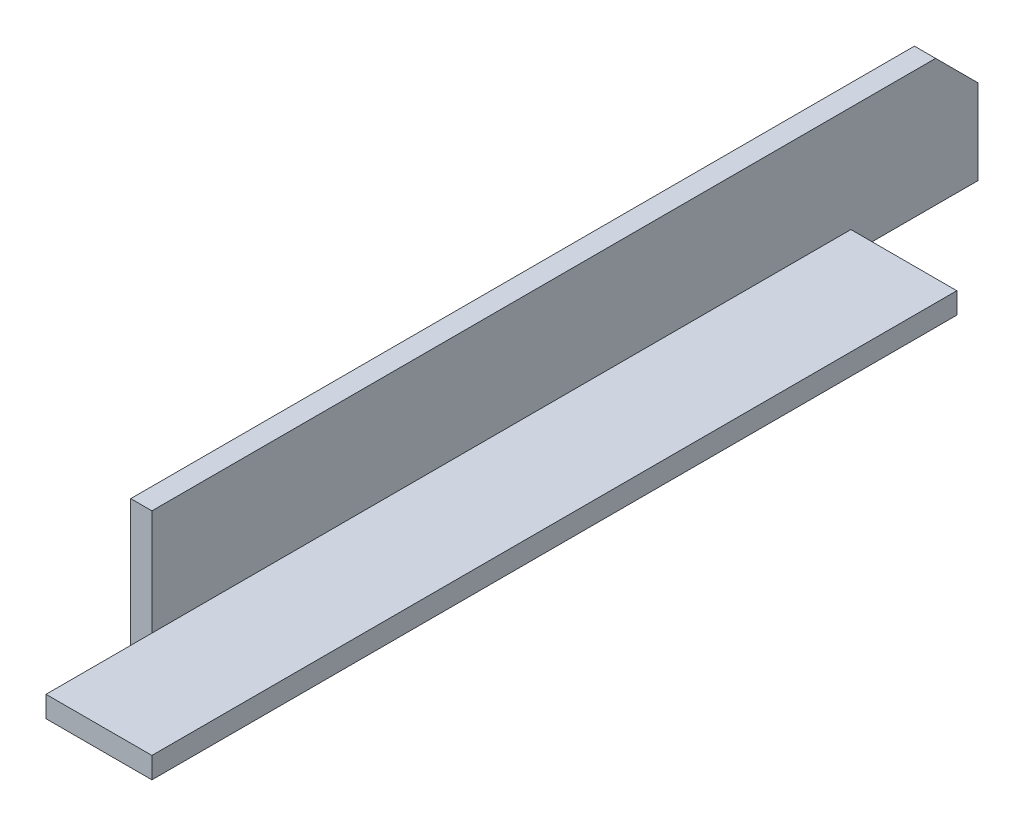
ISO-10303-21;
HEADER;
FILE_DESCRIPTION(('STEP AP214'),'2;1');
FILE_NAME('part.step','',(''),(''),'','','');
FILE_SCHEMA(('AUTOMOTIVE_DESIGN { 1 0 10303 214 1 1 1 1 }'));
ENDSEC;
DATA;
#1=APPLICATION_CONTEXT('core data for automotive mechanical design processes');
#2=APPLICATION_PROTOCOL_DEFINITION('international standard','automotive_design',2000,#1);
#3=PRODUCT_CONTEXT('',#1,'mechanical');
#4=PRODUCT('Part','Part','',(#3));
#5=PRODUCT_RELATED_PRODUCT_CATEGORY('part','',(#4));
#6=PRODUCT_DEFINITION_FORMATION('','',#4);
#7=PRODUCT_DEFINITION_CONTEXT('part definition',#1,'design');
#8=PRODUCT_DEFINITION('design','',#6,#7);
#9=PRODUCT_DEFINITION_SHAPE('','',#8);
#10=(LENGTH_UNIT() NAMED_UNIT(*) SI_UNIT(.MILLI.,.METRE.));
#11=(NAMED_UNIT(*) PLANE_ANGLE_UNIT() SI_UNIT($,.RADIAN.));
#12=(NAMED_UNIT(*) SI_UNIT($,.STERADIAN.) SOLID_ANGLE_UNIT());
#13=UNCERTAINTY_MEASURE_WITH_UNIT(LENGTH_MEASURE(1.E-05),#10,'distance_accuracy_value','');
#14=(GEOMETRIC_REPRESENTATION_CONTEXT(3) GLOBAL_UNCERTAINTY_ASSIGNED_CONTEXT((#13)) GLOBAL_UNIT_ASSIGNED_CONTEXT((#10,
#11,#12)) REPRESENTATION_CONTEXT('',''));
#15=CARTESIAN_POINT('',(0.,0.,0.));
#16=DIRECTION('',(0.,0.,1.));
#17=DIRECTION('',(1.,0.,0.));
#18=AXIS2_PLACEMENT_3D('',#15,#16,#17);
#19=CARTESIAN_POINT('',(0.,0.,279.4));
#20=DIRECTION('',(0.,1.,0.));
#21=DIRECTION('',(-1.,0.,0.));
#22=AXIS2_PLACEMENT_3D('',#19,#20,#21);
#23=PLANE('',#22);
#24=DIRECTION('',(1.,0.,0.));
#25=VECTOR('',#24,1.);
#26=CARTESIAN_POINT('',(0.,0.,0.));
#27=LINE('',#26,#25);
#28=CARTESIAN_POINT('',(0.,0.,0.));
#29=VERTEX_POINT('',#28);
#30=CARTESIAN_POINT('',(6.35,0.,0.));
#31=VERTEX_POINT('',#30);
#32=EDGE_CURVE('E134',#29,#31,#27,.T.);
#33=ORIENTED_EDGE('',*,*,#32,.T.);
#34=DIRECTION('',(0.,0.,-1.));
#35=VECTOR('',#34,1.);
#36=CARTESIAN_POINT('',(6.35,0.,0.));
#37=LINE('',#36,#35);
#38=CARTESIAN_POINT('',(6.35,0.,38.1));
#39=VERTEX_POINT('',#38);
#40=EDGE_CURVE('E178',#39,#31,#37,.T.);
#41=ORIENTED_EDGE('',*,*,#40,.F.);
#42=DIRECTION('',(-1.,0.,0.));
#43=VECTOR('',#42,1.);
#44=CARTESIAN_POINT('',(38.1,4.23272528138341E-13,38.1));
#45=LINE('',#44,#43);
#46=CARTESIAN_POINT('',(38.1,4.23272528138341E-13,38.1));
#47=VERTEX_POINT('',#46);
#48=EDGE_CURVE('E177',#47,#39,#45,.T.);
#49=ORIENTED_EDGE('',*,*,#48,.F.);
#50=DIRECTION('',(0.,0.,-1.));
#51=VECTOR('',#50,1.);
#52=CARTESIAN_POINT('',(38.1,4.23272528138341E-13,279.4));
#53=LINE('',#52,#51);
#54=CARTESIAN_POINT('',(38.1,4.23272528138341E-13,279.4));
#55=VERTEX_POINT('',#54);
#56=EDGE_CURVE('E52',#55,#47,#53,.T.);
#57=ORIENTED_EDGE('',*,*,#56,.F.);
#58=DIRECTION('',(1.,0.,0.));
#59=VECTOR('',#58,1.);
#60=CARTESIAN_POINT('',(0.,0.,279.4));
#61=LINE('',#60,#59);
#62=CARTESIAN_POINT('',(6.35,0.,279.4));
#63=VERTEX_POINT('',#62);
#64=EDGE_CURVE('E136',#63,#55,#61,.T.);
#65=ORIENTED_EDGE('',*,*,#64,.F.);
#66=DIRECTION('',(0.,0.,1.));
#67=VECTOR('',#66,1.);
#68=CARTESIAN_POINT('',(6.35,0.,279.4));
#69=LINE('',#68,#67);
#70=CARTESIAN_POINT('',(6.35,0.,247.65));
#71=VERTEX_POINT('',#70);
#72=EDGE_CURVE('E206',#71,#63,#69,.T.);
#73=ORIENTED_EDGE('',*,*,#72,.F.);
#74=DIRECTION('',(-1.,0.,0.));
#75=VECTOR('',#74,1.);
#76=CARTESIAN_POINT('',(6.35,0.,247.65));
#77=LINE('',#76,#75);
#78=CARTESIAN_POINT('',(0.,0.,247.65));
#79=VERTEX_POINT('',#78);
#80=EDGE_CURVE('E212',#71,#79,#77,.T.);
#81=ORIENTED_EDGE('',*,*,#80,.T.);
#82=DIRECTION('',(0.,0.,-1.));
#83=VECTOR('',#82,1.);
#84=CARTESIAN_POINT('',(0.,0.,279.4));
#85=LINE('',#84,#83);
#86=EDGE_CURVE('E145',#79,#29,#85,.T.);
#87=ORIENTED_EDGE('',*,*,#86,.T.);
#88=EDGE_LOOP('',(#33,#41,#49,#57,#65,#73,#81,#87));
#89=FACE_BOUND('',#88,.T.);
#90=ADVANCED_FACE('F44',(#89),#23,.F.);
#91=CARTESIAN_POINT('',(38.1,4.23272528138341E-13,279.4));
#92=DIRECTION('',(-1.,0.,0.));
#93=DIRECTION('',(0.,-1.,0.));
#94=AXIS2_PLACEMENT_3D('',#91,#92,#93);
#95=PLANE('',#94);
#96=ORIENTED_EDGE('',*,*,#56,.T.);
#97=DIRECTION('',(0.,-1.,0.));
#98=VECTOR('',#97,1.);
#99=CARTESIAN_POINT('',(38.0999999999996,38.1000000000004,38.1));
#100=LINE('',#99,#98);
#101=CARTESIAN_POINT('',(38.0999999999999,6.35000000000026,38.1));
#102=VERTEX_POINT('',#101);
#103=EDGE_CURVE('E170',#102,#47,#100,.T.);
#104=ORIENTED_EDGE('',*,*,#103,.F.);
#105=DIRECTION('',(0.,0.,-1.));
#106=VECTOR('',#105,1.);
#107=CARTESIAN_POINT('',(38.0999999999999,6.35000000000042,279.4));
#108=LINE('',#107,#106);
#109=CARTESIAN_POINT('',(38.0999999999999,6.35000000000042,279.4));
#110=VERTEX_POINT('',#109);
#111=EDGE_CURVE('E159',#110,#102,#108,.T.);
#112=ORIENTED_EDGE('',*,*,#111,.F.);
#113=DIRECTION('',(0.,1.,0.));
#114=VECTOR('',#113,1.);
#115=CARTESIAN_POINT('',(38.1,4.23272528138341E-13,279.4));
#116=LINE('',#115,#114);
#117=EDGE_CURVE('E140',#55,#110,#116,.T.);
#118=ORIENTED_EDGE('',*,*,#117,.F.);
#119=EDGE_LOOP('',(#96,#104,#112,#118));
#120=FACE_BOUND('',#119,.T.);
#121=ADVANCED_FACE('F168',(#120),#95,.F.);
#122=CARTESIAN_POINT('',(38.0999999999999,6.35000000000042,279.4));
#123=DIRECTION('',(0.,-1.,0.));
#124=DIRECTION('',(1.,0.,0.));
#125=AXIS2_PLACEMENT_3D('',#122,#123,#124);
#126=PLANE('',#125);
#127=ORIENTED_EDGE('',*,*,#111,.T.);
#128=DIRECTION('',(-1.,0.,0.));
#129=VECTOR('',#128,1.);
#130=CARTESIAN_POINT('',(38.1,6.35000000000042,38.1));
#131=LINE('',#130,#129);
#132=CARTESIAN_POINT('',(6.34999999999993,6.35000000000008,38.1));
#133=VERTEX_POINT('',#132);
#134=EDGE_CURVE('E191',#102,#133,#131,.T.);
#135=ORIENTED_EDGE('',*,*,#134,.T.);
#136=DIRECTION('',(0.,0.,-1.));
#137=VECTOR('',#136,1.);
#138=CARTESIAN_POINT('',(6.35,6.35000000000007,279.4));
#139=LINE('',#138,#137);
#140=CARTESIAN_POINT('',(6.35,6.35000000000007,247.65));
#141=VERTEX_POINT('',#140);
#142=EDGE_CURVE('E155',#141,#133,#139,.T.);
#143=ORIENTED_EDGE('',*,*,#142,.F.);
#144=CARTESIAN_POINT('',(6.35,6.35000000000026,279.4));
#145=VERTEX_POINT('',#144);
#146=EDGE_CURVE('E156',#145,#141,#139,.T.);
#147=ORIENTED_EDGE('',*,*,#146,.F.);
#148=DIRECTION('',(-1.,0.,0.));
#149=VECTOR('',#148,1.);
#150=CARTESIAN_POINT('',(38.0999999999999,6.35000000000042,279.4));
#151=LINE('',#150,#149);
#152=EDGE_CURVE('E148',#110,#145,#151,.T.);
#153=ORIENTED_EDGE('',*,*,#152,.F.);
#154=EDGE_LOOP('',(#127,#135,#143,#147,#153));
#155=FACE_BOUND('',#154,.T.);
#156=ADVANCED_FACE('F236',(#155),#126,.F.);
#157=CARTESIAN_POINT('',(6.35,38.1,279.4));
#158=DIRECTION('',(-1.,0.,0.));
#159=DIRECTION('',(0.,-1.,0.));
#160=AXIS2_PLACEMENT_3D('',#157,#158,#159);
#161=PLANE('',#160);
#162=DIRECTION('',(0.,1.,0.));
#163=VECTOR('',#162,1.);
#164=CARTESIAN_POINT('',(6.35,38.1,0.));
#165=LINE('',#164,#163);
#166=CARTESIAN_POINT('',(6.35,25.4,0.));
#167=VERTEX_POINT('',#166);
#168=EDGE_CURVE('E65',#31,#167,#165,.T.);
#169=ORIENTED_EDGE('',*,*,#168,.T.);
#170=DIRECTION('',(0.,0.707106781186547,0.707106781186548));
#171=VECTOR('',#170,1.);
#172=CARTESIAN_POINT('',(6.34999999999999,171.45,146.05));
#173=LINE('',#172,#171);
#174=CARTESIAN_POINT('',(6.35,38.1,12.7));
#175=VERTEX_POINT('',#174);
#176=EDGE_CURVE('E59',#167,#175,#173,.T.);
#177=ORIENTED_EDGE('',*,*,#176,.T.);
#178=DIRECTION('',(0.,0.,-1.));
#179=VECTOR('',#178,1.);
#180=CARTESIAN_POINT('',(6.35,38.1,279.4));
#181=LINE('',#180,#179);
#182=CARTESIAN_POINT('',(6.35,38.1,247.65));
#183=VERTEX_POINT('',#182);
#184=EDGE_CURVE('E151',#183,#175,#181,.T.);
#185=ORIENTED_EDGE('',*,*,#184,.F.);
#186=DIRECTION('',(0.,-1.,0.));
#187=VECTOR('',#186,1.);
#188=CARTESIAN_POINT('',(6.35,38.1,247.65));
#189=LINE('',#188,#187);
#190=EDGE_CURVE('E202',#183,#141,#189,.T.);
#191=ORIENTED_EDGE('',*,*,#190,.T.);
#192=ORIENTED_EDGE('',*,*,#142,.T.);
#193=DIRECTION('',(0.,-1.,0.));
#194=VECTOR('',#193,1.);
#195=CARTESIAN_POINT('',(6.34999999999958,38.1000000000001,38.1));
#196=LINE('',#195,#194);
#197=EDGE_CURVE('E188',#133,#39,#196,.T.);
#198=ORIENTED_EDGE('',*,*,#197,.T.);
#199=ORIENTED_EDGE('',*,*,#40,.T.);
#200=EDGE_LOOP('',(#169,#177,#185,#191,#192,#198,#199));
#201=FACE_BOUND('',#200,.T.);
#202=ADVANCED_FACE('F231',(#201),#161,.F.);
#203=CARTESIAN_POINT('',(0.,38.1,279.4));
#204=DIRECTION('',(0.,-1.,0.));
#205=DIRECTION('',(0.,0.,-1.));
#206=AXIS2_PLACEMENT_3D('',#203,#204,#205);
#207=PLANE('',#206);
#208=ORIENTED_EDGE('',*,*,#184,.T.);
#209=DIRECTION('',(-1.,0.,0.));
#210=VECTOR('',#209,1.);
#211=CARTESIAN_POINT('',(38.1,38.1,12.7));
#212=LINE('',#211,#210);
#213=CARTESIAN_POINT('',(0.,38.1,12.7));
#214=VERTEX_POINT('',#213);
#215=EDGE_CURVE('E130',#175,#214,#212,.T.);
#216=ORIENTED_EDGE('',*,*,#215,.T.);
#217=DIRECTION('',(0.,0.,-1.));
#218=VECTOR('',#217,1.);
#219=CARTESIAN_POINT('',(0.,38.1,279.4));
#220=LINE('',#219,#218);
#221=CARTESIAN_POINT('',(0.,38.1,247.65));
#222=VERTEX_POINT('',#221);
#223=EDGE_CURVE('E128',#222,#214,#220,.T.);
#224=ORIENTED_EDGE('',*,*,#223,.F.);
#225=DIRECTION('',(-1.,0.,0.));
#226=VECTOR('',#225,1.);
#227=CARTESIAN_POINT('',(6.35,38.1,247.65));
#228=LINE('',#227,#226);
#229=EDGE_CURVE('E209',#183,#222,#228,.T.);
#230=ORIENTED_EDGE('',*,*,#229,.F.);
#231=EDGE_LOOP('',(#208,#216,#224,#230));
#232=FACE_BOUND('',#231,.T.);
#233=ADVANCED_FACE('F227',(#232),#207,.F.);
#234=CARTESIAN_POINT('',(0.,0.,279.4));
#235=DIRECTION('',(1.,0.,0.));
#236=DIRECTION('',(0.,0.,-1.));
#237=AXIS2_PLACEMENT_3D('',#234,#235,#236);
#238=PLANE('',#237);
#239=ORIENTED_EDGE('',*,*,#223,.T.);
#240=DIRECTION('',(0.,0.707106781186547,0.707106781186548));
#241=VECTOR('',#240,1.);
#242=CARTESIAN_POINT('',(0.,25.4,0.));
#243=LINE('',#242,#241);
#244=CARTESIAN_POINT('',(0.,25.4,0.));
#245=VERTEX_POINT('',#244);
#246=EDGE_CURVE('E117',#245,#214,#243,.T.);
#247=ORIENTED_EDGE('',*,*,#246,.F.);
#248=DIRECTION('',(0.,-1.,0.));
#249=VECTOR('',#248,1.);
#250=CARTESIAN_POINT('',(0.,0.,0.));
#251=LINE('',#250,#249);
#252=EDGE_CURVE('E124',#245,#29,#251,.T.);
#253=ORIENTED_EDGE('',*,*,#252,.T.);
#254=ORIENTED_EDGE('',*,*,#86,.F.);
#255=DIRECTION('',(0.,-1.,0.));
#256=VECTOR('',#255,1.);
#257=CARTESIAN_POINT('',(0.,38.1,247.65));
#258=LINE('',#257,#256);
#259=EDGE_CURVE('E197',#222,#79,#258,.T.);
#260=ORIENTED_EDGE('',*,*,#259,.F.);
#261=EDGE_LOOP('',(#239,#247,#253,#254,#260));
#262=FACE_BOUND('',#261,.T.);
#263=ADVANCED_FACE('F122',(#262),#238,.F.);
#264=CARTESIAN_POINT('',(0.,0.,279.4));
#265=DIRECTION('',(0.,0.,1.));
#266=DIRECTION('',(1.,0.,0.));
#267=AXIS2_PLACEMENT_3D('',#264,#265,#266);
#268=PLANE('',#267);
#269=DIRECTION('',(0.,1.,0.));
#270=VECTOR('',#269,1.);
#271=CARTESIAN_POINT('',(6.35,38.1,279.4));
#272=LINE('',#271,#270);
#273=EDGE_CURVE('E198',#63,#145,#272,.T.);
#274=ORIENTED_EDGE('',*,*,#273,.F.);
#275=ORIENTED_EDGE('',*,*,#64,.T.);
#276=ORIENTED_EDGE('',*,*,#117,.T.);
#277=ORIENTED_EDGE('',*,*,#152,.T.);
#278=EDGE_LOOP('',(#274,#275,#276,#277));
#279=FACE_BOUND('',#278,.T.);
#280=ADVANCED_FACE('F241',(#279),#268,.T.);
#281=CARTESIAN_POINT('',(0.,0.,0.));
#282=DIRECTION('',(0.,0.,1.));
#283=DIRECTION('',(1.,0.,0.));
#284=AXIS2_PLACEMENT_3D('',#281,#282,#283);
#285=PLANE('',#284);
#286=ORIENTED_EDGE('',*,*,#252,.F.);
#287=DIRECTION('',(1.,0.,0.));
#288=VECTOR('',#287,1.);
#289=CARTESIAN_POINT('',(0.,25.4,0.));
#290=LINE('',#289,#288);
#291=EDGE_CURVE('E11',#245,#167,#290,.T.);
#292=ORIENTED_EDGE('',*,*,#291,.T.);
#293=ORIENTED_EDGE('',*,*,#168,.F.);
#294=ORIENTED_EDGE('',*,*,#32,.F.);
#295=EDGE_LOOP('',(#286,#292,#293,#294));
#296=FACE_BOUND('',#295,.T.);
#297=ADVANCED_FACE('F132',(#296),#285,.F.);
#298=CARTESIAN_POINT('',(6.35,0.,0.));
#299=DIRECTION('',(1.,0.,0.));
#300=DIRECTION('',(0.,0.,-1.));
#301=AXIS2_PLACEMENT_3D('',#298,#299,#300);
#302=PLANE('',#301);
#303=EDGE_CURVE('E201',#141,#71,#189,.T.);
#304=ORIENTED_EDGE('',*,*,#303,.T.);
#305=ORIENTED_EDGE('',*,*,#72,.T.);
#306=ORIENTED_EDGE('',*,*,#273,.T.);
#307=ORIENTED_EDGE('',*,*,#146,.T.);
#308=EDGE_LOOP('',(#304,#305,#306,#307));
#309=FACE_BOUND('',#308,.T.);
#310=ADVANCED_FACE('F243',(#309),#302,.F.);
#311=CARTESIAN_POINT('',(6.35,38.1,247.65));
#312=DIRECTION('',(0.,0.,-1.));
#313=DIRECTION('',(-1.,0.,0.));
#314=AXIS2_PLACEMENT_3D('',#311,#312,#313);
#315=PLANE('',#314);
#316=ORIENTED_EDGE('',*,*,#259,.T.);
#317=ORIENTED_EDGE('',*,*,#80,.F.);
#318=ORIENTED_EDGE('',*,*,#303,.F.);
#319=ORIENTED_EDGE('',*,*,#190,.F.);
#320=ORIENTED_EDGE('',*,*,#229,.T.);
#321=EDGE_LOOP('',(#316,#317,#318,#319,#320));
#322=FACE_BOUND('',#321,.T.);
#323=ADVANCED_FACE('F246',(#322),#315,.F.);
#324=CARTESIAN_POINT('',(38.0999999999996,38.1000000000004,38.1));
#325=DIRECTION('',(0.,0.,1.));
#326=DIRECTION('',(1.,0.,0.));
#327=AXIS2_PLACEMENT_3D('',#324,#325,#326);
#328=PLANE('',#327);
#329=ORIENTED_EDGE('',*,*,#103,.T.);
#330=ORIENTED_EDGE('',*,*,#48,.T.);
#331=ORIENTED_EDGE('',*,*,#197,.F.);
#332=ORIENTED_EDGE('',*,*,#134,.F.);
#333=EDGE_LOOP('',(#329,#330,#331,#332));
#334=FACE_BOUND('',#333,.T.);
#335=ADVANCED_FACE('F234',(#334),#328,.F.);
#336=CARTESIAN_POINT('',(38.1,25.4,0.));
#337=DIRECTION('',(0.,-0.707106781186548,0.707106781186547));
#338=DIRECTION('',(0.,-0.707106781186547,-0.707106781186548));
#339=AXIS2_PLACEMENT_3D('',#336,#337,#338);
#340=PLANE('',#339);
#341=ORIENTED_EDGE('',*,*,#291,.F.);
#342=ORIENTED_EDGE('',*,*,#246,.T.);
#343=ORIENTED_EDGE('',*,*,#215,.F.);
#344=ORIENTED_EDGE('',*,*,#176,.F.);
#345=EDGE_LOOP('',(#341,#342,#343,#344));
#346=FACE_BOUND('',#345,.T.);
#347=ADVANCED_FACE('F116',(#346),#340,.F.);
#348=CLOSED_SHELL('',(#90,#121,#156,#202,#233,#263,#280,#297,#310,#323,#335,#347));
#349=MANIFOLD_SOLID_BREP('B2',#348);
#350=ADVANCED_BREP_SHAPE_REPRESENTATION('',(#18,#349),#14);
#351=SHAPE_DEFINITION_REPRESENTATION(#9,#350);
ENDSEC;
END-ISO-10303-21;
